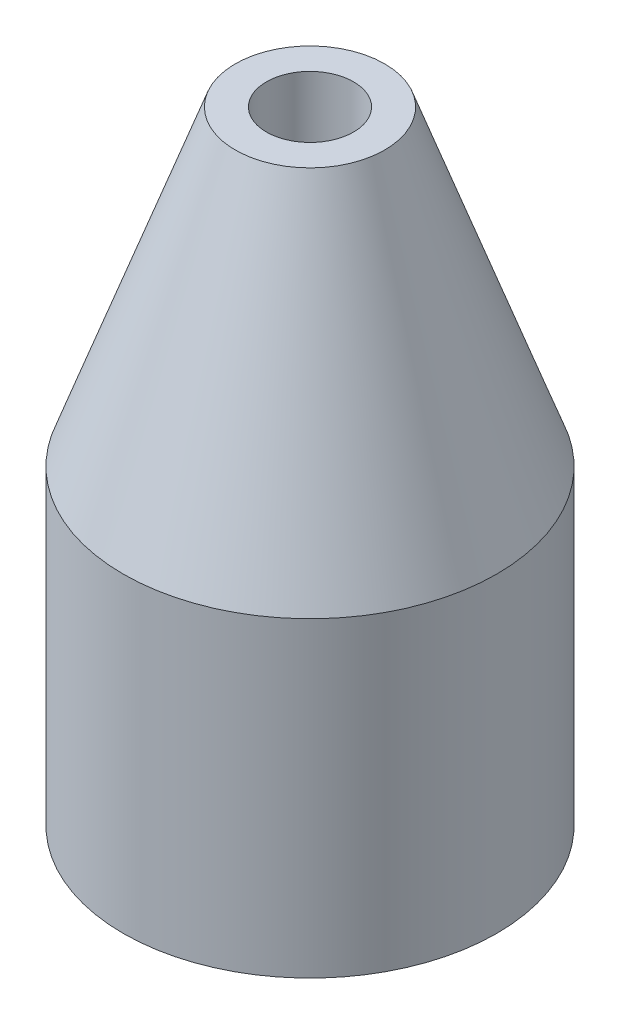
ISO-10303-21;
HEADER;
FILE_DESCRIPTION(('STEP AP214'),'2;1');
FILE_NAME('part.step','',(''),(''),'','','');
FILE_SCHEMA(('AUTOMOTIVE_DESIGN { 1 0 10303 214 1 1 1 1 }'));
ENDSEC;
DATA;
#1=APPLICATION_CONTEXT('core data for automotive mechanical design processes');
#2=APPLICATION_PROTOCOL_DEFINITION('international standard','automotive_design',2000,#1);
#3=PRODUCT_CONTEXT('',#1,'mechanical');
#4=PRODUCT('Part','Part','',(#3));
#5=PRODUCT_RELATED_PRODUCT_CATEGORY('part','',(#4));
#6=PRODUCT_DEFINITION_FORMATION('','',#4);
#7=PRODUCT_DEFINITION_CONTEXT('part definition',#1,'design');
#8=PRODUCT_DEFINITION('design','',#6,#7);
#9=PRODUCT_DEFINITION_SHAPE('','',#8);
#10=(LENGTH_UNIT() NAMED_UNIT(*) SI_UNIT(.MILLI.,.METRE.));
#11=(NAMED_UNIT(*) PLANE_ANGLE_UNIT() SI_UNIT($,.RADIAN.));
#12=(NAMED_UNIT(*) SI_UNIT($,.STERADIAN.) SOLID_ANGLE_UNIT());
#13=UNCERTAINTY_MEASURE_WITH_UNIT(LENGTH_MEASURE(1.E-05),#10,'distance_accuracy_value','');
#14=(GEOMETRIC_REPRESENTATION_CONTEXT(3) GLOBAL_UNCERTAINTY_ASSIGNED_CONTEXT((#13)) GLOBAL_UNIT_ASSIGNED_CONTEXT((#10,
#11,#12)) REPRESENTATION_CONTEXT('',''));
#15=CARTESIAN_POINT('',(0.,0.,0.));
#16=DIRECTION('',(0.,0.,1.));
#17=DIRECTION('',(1.,0.,0.));
#18=AXIS2_PLACEMENT_3D('',#15,#16,#17);
#19=CARTESIAN_POINT('',(3.81,12.7,0.));
#20=DIRECTION('',(0.,-1.,0.));
#21=DIRECTION('',(0.,0.,-1.));
#22=AXIS2_PLACEMENT_3D('',#19,#20,#21);
#23=CONICAL_SURFACE('',#22,1.524,0.345555580581712);
#24=CARTESIAN_POINT('',(3.81,6.35,0.));
#25=DIRECTION('',(0.,-1.,0.));
#26=DIRECTION('',(0.,0.,-1.));
#27=AXIS2_PLACEMENT_3D('',#24,#25,#26);
#28=CIRCLE('',#27,3.81);
#29=CARTESIAN_POINT('',(3.81,6.35,-3.81));
#30=VERTEX_POINT('',#29);
#31=EDGE_CURVE('E51',#30,#30,#28,.T.);
#32=ORIENTED_EDGE('',*,*,#31,.F.);
#33=EDGE_LOOP('',(#32));
#34=FACE_BOUND('',#33,.T.);
#35=CARTESIAN_POINT('',(3.81,12.7,0.));
#36=DIRECTION('',(0.,-1.,0.));
#37=DIRECTION('',(0.,0.,-1.));
#38=AXIS2_PLACEMENT_3D('',#35,#36,#37);
#39=CIRCLE('',#38,1.524);
#40=CARTESIAN_POINT('',(3.81,12.7,-1.524));
#41=VERTEX_POINT('',#40);
#42=EDGE_CURVE('E10',#41,#41,#39,.T.);
#43=ORIENTED_EDGE('',*,*,#42,.T.);
#44=EDGE_LOOP('',(#43));
#45=FACE_BOUND('',#44,.T.);
#46=ADVANCED_FACE('F39',(#34,#45),#23,.T.);
#47=CARTESIAN_POINT('',(0.,12.7,0.));
#48=DIRECTION('',(0.,-1.,0.));
#49=DIRECTION('',(0.,0.,-1.));
#50=AXIS2_PLACEMENT_3D('',#47,#48,#49);
#51=PLANE('',#50);
#52=CARTESIAN_POINT('',(3.81,12.7,0.));
#53=DIRECTION('',(0.,1.,0.));
#54=DIRECTION('',(0.,0.,1.));
#55=AXIS2_PLACEMENT_3D('',#52,#53,#54);
#56=CIRCLE('',#55,0.889);
#57=CARTESIAN_POINT('',(3.81,12.7,0.889));
#58=VERTEX_POINT('',#57);
#59=EDGE_CURVE('E59',#58,#58,#56,.T.);
#60=ORIENTED_EDGE('',*,*,#59,.F.);
#61=EDGE_LOOP('',(#60));
#62=FACE_BOUND('',#61,.T.);
#63=ORIENTED_EDGE('',*,*,#42,.F.);
#64=EDGE_LOOP('',(#63));
#65=FACE_BOUND('',#64,.T.);
#66=ADVANCED_FACE('F76',(#62,#65),#51,.F.);
#67=CARTESIAN_POINT('',(0.,0.,0.));
#68=DIRECTION('',(0.,-1.,0.));
#69=DIRECTION('',(0.,0.,-1.));
#70=AXIS2_PLACEMENT_3D('',#67,#68,#69);
#71=PLANE('',#70);
#72=CARTESIAN_POINT('',(3.81,0.,0.));
#73=DIRECTION('',(0.,1.,0.));
#74=DIRECTION('',(0.,0.,1.));
#75=AXIS2_PLACEMENT_3D('',#72,#73,#74);
#76=CIRCLE('',#75,0.889);
#77=CARTESIAN_POINT('',(3.81,0.,0.889));
#78=VERTEX_POINT('',#77);
#79=EDGE_CURVE('E56',#78,#78,#76,.T.);
#80=ORIENTED_EDGE('',*,*,#79,.T.);
#81=EDGE_LOOP('',(#80));
#82=FACE_BOUND('',#81,.T.);
#83=CARTESIAN_POINT('',(3.81,0.,0.));
#84=DIRECTION('',(0.,-1.,0.));
#85=DIRECTION('',(0.,0.,-1.));
#86=AXIS2_PLACEMENT_3D('',#83,#84,#85);
#87=CIRCLE('',#86,3.81);
#88=CARTESIAN_POINT('',(3.81,0.,-3.81));
#89=VERTEX_POINT('',#88);
#90=EDGE_CURVE('E46',#89,#89,#87,.T.);
#91=ORIENTED_EDGE('',*,*,#90,.T.);
#92=EDGE_LOOP('',(#91));
#93=FACE_BOUND('',#92,.T.);
#94=ADVANCED_FACE('F67',(#82,#93),#71,.T.);
#95=CARTESIAN_POINT('',(3.81,0.,0.));
#96=DIRECTION('',(0.,-1.,0.));
#97=DIRECTION('',(0.,0.,-1.));
#98=AXIS2_PLACEMENT_3D('',#95,#96,#97);
#99=CYLINDRICAL_SURFACE('',#98,3.81);
#100=ORIENTED_EDGE('',*,*,#31,.T.);
#101=EDGE_LOOP('',(#100));
#102=FACE_BOUND('',#101,.T.);
#103=ORIENTED_EDGE('',*,*,#90,.F.);
#104=EDGE_LOOP('',(#103));
#105=FACE_BOUND('',#104,.T.);
#106=ADVANCED_FACE('F72',(#102,#105),#99,.T.);
#107=CARTESIAN_POINT('',(3.81,0.,0.));
#108=DIRECTION('',(0.,1.,0.));
#109=DIRECTION('',(0.,0.,1.));
#110=AXIS2_PLACEMENT_3D('',#107,#108,#109);
#111=CYLINDRICAL_SURFACE('',#110,0.889);
#112=ORIENTED_EDGE('',*,*,#79,.F.);
#113=EDGE_LOOP('',(#112));
#114=FACE_BOUND('',#113,.T.);
#115=ORIENTED_EDGE('',*,*,#59,.T.);
#116=EDGE_LOOP('',(#115));
#117=FACE_BOUND('',#116,.T.);
#118=ADVANCED_FACE('F69',(#114,#117),#111,.F.);
#119=CLOSED_SHELL('',(#46,#66,#94,#106,#118));
#120=MANIFOLD_SOLID_BREP('B2',#119);
#121=ADVANCED_BREP_SHAPE_REPRESENTATION('',(#18,#120),#14);
#122=SHAPE_DEFINITION_REPRESENTATION(#9,#121);
ENDSEC;
END-ISO-10303-21;
